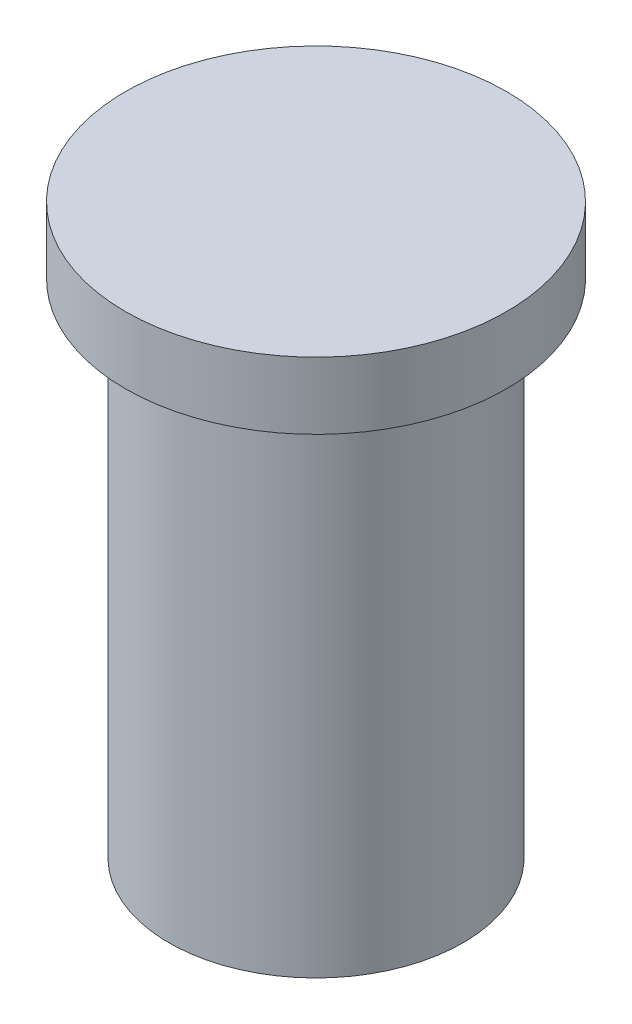
ISO-10303-21;
HEADER;
FILE_DESCRIPTION(('STEP AP214'),'2;1');
FILE_NAME('part.step','',(''),(''),'','','');
FILE_SCHEMA(('AUTOMOTIVE_DESIGN { 1 0 10303 214 1 1 1 1 }'));
ENDSEC;
DATA;
#1=APPLICATION_CONTEXT('core data for automotive mechanical design processes');
#2=APPLICATION_PROTOCOL_DEFINITION('international standard','automotive_design',2000,#1);
#3=PRODUCT_CONTEXT('',#1,'mechanical');
#4=PRODUCT('Part','Part','',(#3));
#5=PRODUCT_RELATED_PRODUCT_CATEGORY('part','',(#4));
#6=PRODUCT_DEFINITION_FORMATION('','',#4);
#7=PRODUCT_DEFINITION_CONTEXT('part definition',#1,'design');
#8=PRODUCT_DEFINITION('design','',#6,#7);
#9=PRODUCT_DEFINITION_SHAPE('','',#8);
#10=(LENGTH_UNIT() NAMED_UNIT(*) SI_UNIT(.MILLI.,.METRE.));
#11=(NAMED_UNIT(*) PLANE_ANGLE_UNIT() SI_UNIT($,.RADIAN.));
#12=(NAMED_UNIT(*) SI_UNIT($,.STERADIAN.) SOLID_ANGLE_UNIT());
#13=UNCERTAINTY_MEASURE_WITH_UNIT(LENGTH_MEASURE(1.E-05),#10,'distance_accuracy_value','');
#14=(GEOMETRIC_REPRESENTATION_CONTEXT(3) GLOBAL_UNCERTAINTY_ASSIGNED_CONTEXT((#13)) GLOBAL_UNIT_ASSIGNED_CONTEXT((#10,
#11,#12)) REPRESENTATION_CONTEXT('',''));
#15=CARTESIAN_POINT('',(0.,0.,0.));
#16=DIRECTION('',(0.,0.,1.));
#17=DIRECTION('',(1.,0.,0.));
#18=AXIS2_PLACEMENT_3D('',#15,#16,#17);
#19=CARTESIAN_POINT('',(0.,0.,0.));
#20=DIRECTION('',(0.,-1.,0.));
#21=DIRECTION('',(0.,0.,-1.));
#22=AXIS2_PLACEMENT_3D('',#19,#20,#21);
#23=PLANE('',#22);
#24=CARTESIAN_POINT('',(0.,0.,0.));
#25=DIRECTION('',(0.,-1.,0.));
#26=DIRECTION('',(0.,0.,-1.));
#27=AXIS2_PLACEMENT_3D('',#24,#25,#26);
#28=CIRCLE('',#27,22.);
#29=CARTESIAN_POINT('',(0.,0.,-22.));
#30=VERTEX_POINT('',#29);
#31=EDGE_CURVE('E10',#30,#30,#28,.T.);
#32=ORIENTED_EDGE('',*,*,#31,.T.);
#33=EDGE_LOOP('',(#32));
#34=FACE_BOUND('',#33,.T.);
#35=ADVANCED_FACE('F31',(#34),#23,.T.);
#36=CARTESIAN_POINT('',(0.,0.,0.));
#37=DIRECTION('',(0.,-1.,0.));
#38=DIRECTION('',(0.,0.,-1.));
#39=AXIS2_PLACEMENT_3D('',#36,#37,#38);
#40=CYLINDRICAL_SURFACE('',#39,22.);
#41=CARTESIAN_POINT('',(0.,75.,0.));
#42=DIRECTION('',(0.,-1.,0.));
#43=DIRECTION('',(0.,0.,-1.));
#44=AXIS2_PLACEMENT_3D('',#41,#42,#43);
#45=CIRCLE('',#44,22.);
#46=CARTESIAN_POINT('',(0.,75.,-22.));
#47=VERTEX_POINT('',#46);
#48=EDGE_CURVE('E37',#47,#47,#45,.T.);
#49=ORIENTED_EDGE('',*,*,#48,.T.);
#50=EDGE_LOOP('',(#49));
#51=FACE_BOUND('',#50,.T.);
#52=ORIENTED_EDGE('',*,*,#31,.F.);
#53=EDGE_LOOP('',(#52));
#54=FACE_BOUND('',#53,.T.);
#55=ADVANCED_FACE('F63',(#51,#54),#40,.T.);
#56=CARTESIAN_POINT('',(22.,75.,0.));
#57=DIRECTION('',(0.,-1.,0.));
#58=DIRECTION('',(0.,0.,-1.));
#59=AXIS2_PLACEMENT_3D('',#56,#57,#58);
#60=PLANE('',#59);
#61=CARTESIAN_POINT('',(0.,75.,0.));
#62=DIRECTION('',(0.,-1.,0.));
#63=DIRECTION('',(0.,0.,-1.));
#64=AXIS2_PLACEMENT_3D('',#61,#62,#63);
#65=CIRCLE('',#64,28.5);
#66=CARTESIAN_POINT('',(0.,75.,-28.5));
#67=VERTEX_POINT('',#66);
#68=EDGE_CURVE('E41',#67,#67,#65,.T.);
#69=ORIENTED_EDGE('',*,*,#68,.T.);
#70=EDGE_LOOP('',(#69));
#71=FACE_BOUND('',#70,.T.);
#72=ORIENTED_EDGE('',*,*,#48,.F.);
#73=EDGE_LOOP('',(#72));
#74=FACE_BOUND('',#73,.T.);
#75=ADVANCED_FACE('F60',(#71,#74),#60,.T.);
#76=CARTESIAN_POINT('',(0.,0.,0.));
#77=DIRECTION('',(0.,-1.,0.));
#78=DIRECTION('',(0.,0.,-1.));
#79=AXIS2_PLACEMENT_3D('',#76,#77,#78);
#80=CYLINDRICAL_SURFACE('',#79,28.5);
#81=CARTESIAN_POINT('',(0.,85.,0.));
#82=DIRECTION('',(0.,-1.,0.));
#83=DIRECTION('',(0.,0.,-1.));
#84=AXIS2_PLACEMENT_3D('',#81,#82,#83);
#85=CIRCLE('',#84,28.5);
#86=CARTESIAN_POINT('',(0.,85.,-28.5));
#87=VERTEX_POINT('',#86);
#88=EDGE_CURVE('E45',#87,#87,#85,.T.);
#89=ORIENTED_EDGE('',*,*,#88,.T.);
#90=EDGE_LOOP('',(#89));
#91=FACE_BOUND('',#90,.T.);
#92=ORIENTED_EDGE('',*,*,#68,.F.);
#93=EDGE_LOOP('',(#92));
#94=FACE_BOUND('',#93,.T.);
#95=ADVANCED_FACE('F51',(#91,#94),#80,.T.);
#96=CARTESIAN_POINT('',(28.5,85.,0.));
#97=DIRECTION('',(0.,1.,0.));
#98=DIRECTION('',(0.,0.,1.));
#99=AXIS2_PLACEMENT_3D('',#96,#97,#98);
#100=PLANE('',#99);
#101=ORIENTED_EDGE('',*,*,#88,.F.);
#102=EDGE_LOOP('',(#101));
#103=FACE_BOUND('',#102,.T.);
#104=ADVANCED_FACE('F54',(#103),#100,.T.);
#105=CLOSED_SHELL('',(#35,#55,#75,#95,#104));
#106=MANIFOLD_SOLID_BREP('B2',#105);
#107=ADVANCED_BREP_SHAPE_REPRESENTATION('',(#18,#106),#14);
#108=SHAPE_DEFINITION_REPRESENTATION(#9,#107);
ENDSEC;
END-ISO-10303-21;
